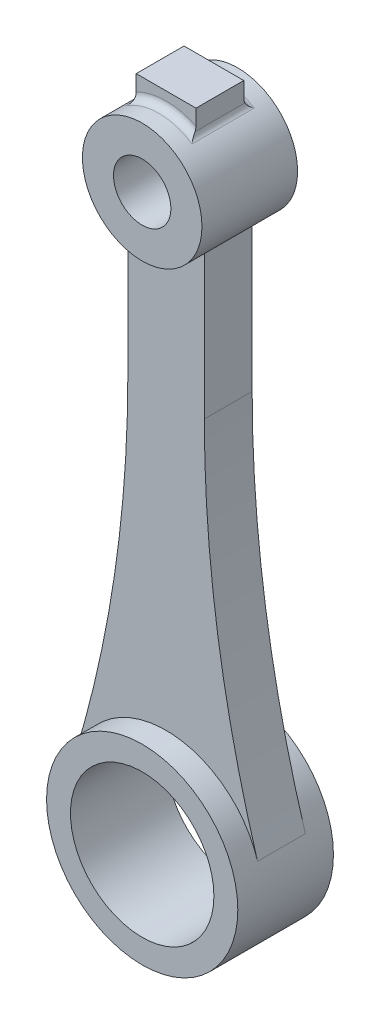
ISO-10303-21;
HEADER;
FILE_DESCRIPTION(('STEP AP214'),'2;1');
FILE_NAME('part.step','',(''),(''),'','','');
FILE_SCHEMA(('AUTOMOTIVE_DESIGN { 1 0 10303 214 1 1 1 1 }'));
ENDSEC;
DATA;
#1=APPLICATION_CONTEXT('core data for automotive mechanical design processes');
#2=APPLICATION_PROTOCOL_DEFINITION('international standard','automotive_design',2000,#1);
#3=PRODUCT_CONTEXT('',#1,'mechanical');
#4=PRODUCT('Part','Part','',(#3));
#5=PRODUCT_RELATED_PRODUCT_CATEGORY('part','',(#4));
#6=PRODUCT_DEFINITION_FORMATION('','',#4);
#7=PRODUCT_DEFINITION_CONTEXT('part definition',#1,'design');
#8=PRODUCT_DEFINITION('design','',#6,#7);
#9=PRODUCT_DEFINITION_SHAPE('','',#8);
#10=(LENGTH_UNIT() NAMED_UNIT(*) SI_UNIT(.MILLI.,.METRE.));
#11=(NAMED_UNIT(*) PLANE_ANGLE_UNIT() SI_UNIT($,.RADIAN.));
#12=(NAMED_UNIT(*) SI_UNIT($,.STERADIAN.) SOLID_ANGLE_UNIT());
#13=UNCERTAINTY_MEASURE_WITH_UNIT(LENGTH_MEASURE(1.E-05),#10,'distance_accuracy_value','');
#14=(GEOMETRIC_REPRESENTATION_CONTEXT(3) GLOBAL_UNCERTAINTY_ASSIGNED_CONTEXT((#13)) GLOBAL_UNIT_ASSIGNED_CONTEXT((#10,
#11,#12)) REPRESENTATION_CONTEXT('',''));
#15=CARTESIAN_POINT('',(0.,0.,0.));
#16=DIRECTION('',(0.,0.,1.));
#17=DIRECTION('',(1.,0.,0.));
#18=AXIS2_PLACEMENT_3D('',#15,#16,#17);
#19=CARTESIAN_POINT('',(0.,0.,10.));
#20=DIRECTION('',(0.,0.,1.));
#21=DIRECTION('',(1.,0.,0.));
#22=AXIS2_PLACEMENT_3D('',#19,#20,#21);
#23=PLANE('',#22);
#24=CARTESIAN_POINT('',(0.,0.,10.));
#25=DIRECTION('',(0.,0.,1.));
#26=DIRECTION('',(1.,0.,0.));
#27=AXIS2_PLACEMENT_3D('',#24,#25,#26);
#28=CIRCLE('',#27,20.);
#29=CARTESIAN_POINT('',(20.,0.,10.));
#30=VERTEX_POINT('',#29);
#31=EDGE_CURVE('E235',#30,#30,#28,.T.);
#32=ORIENTED_EDGE('',*,*,#31,.T.);
#33=EDGE_LOOP('',(#32));
#34=FACE_BOUND('',#33,.T.);
#35=CARTESIAN_POINT('',(0.,0.,10.));
#36=DIRECTION('',(0.,0.,1.));
#37=DIRECTION('',(1.,0.,0.));
#38=AXIS2_PLACEMENT_3D('',#35,#36,#37);
#39=CIRCLE('',#38,15.);
#40=CARTESIAN_POINT('',(15.,0.,10.));
#41=VERTEX_POINT('',#40);
#42=EDGE_CURVE('E229',#41,#41,#39,.T.);
#43=ORIENTED_EDGE('',*,*,#42,.F.);
#44=EDGE_LOOP('',(#43));
#45=FACE_BOUND('',#44,.T.);
#46=ADVANCED_FACE('F35',(#34,#45),#23,.T.);
#47=CARTESIAN_POINT('',(0.,0.,-10.));
#48=DIRECTION('',(0.,0.,1.));
#49=DIRECTION('',(1.,0.,0.));
#50=AXIS2_PLACEMENT_3D('',#47,#48,#49);
#51=PLANE('',#50);
#52=CARTESIAN_POINT('',(0.,0.,-10.));
#53=DIRECTION('',(0.,0.,1.));
#54=DIRECTION('',(1.,0.,0.));
#55=AXIS2_PLACEMENT_3D('',#52,#53,#54);
#56=CIRCLE('',#55,20.);
#57=CARTESIAN_POINT('',(20.,0.,-10.));
#58=VERTEX_POINT('',#57);
#59=EDGE_CURVE('E232',#58,#58,#56,.T.);
#60=ORIENTED_EDGE('',*,*,#59,.F.);
#61=EDGE_LOOP('',(#60));
#62=FACE_BOUND('',#61,.T.);
#63=CARTESIAN_POINT('',(0.,0.,-10.));
#64=DIRECTION('',(0.,0.,1.));
#65=DIRECTION('',(1.,0.,0.));
#66=AXIS2_PLACEMENT_3D('',#63,#64,#65);
#67=CIRCLE('',#66,15.);
#68=CARTESIAN_POINT('',(15.,0.,-10.));
#69=VERTEX_POINT('',#68);
#70=EDGE_CURVE('E228',#69,#69,#67,.T.);
#71=ORIENTED_EDGE('',*,*,#70,.T.);
#72=EDGE_LOOP('',(#71));
#73=FACE_BOUND('',#72,.T.);
#74=ADVANCED_FACE('F389',(#62,#73),#51,.F.);
#75=CARTESIAN_POINT('',(0.,0.,10.));
#76=DIRECTION('',(0.,0.,-1.));
#77=DIRECTION('',(-1.,0.,0.));
#78=AXIS2_PLACEMENT_3D('',#75,#76,#77);
#79=CYLINDRICAL_SURFACE('',#78,20.);
#80=DIRECTION('',(0.,0.,-1.));
#81=VECTOR('',#80,1.);
#82=CARTESIAN_POINT('',(19.1282509955381,5.84037788603577,5.));
#83=LINE('',#82,#81);
#84=CARTESIAN_POINT('',(19.1282509955381,5.84037788603577,5.));
#85=VERTEX_POINT('',#84);
#86=CARTESIAN_POINT('',(19.128250995538,5.84037788603575,-5.));
#87=VERTEX_POINT('',#86);
#88=EDGE_CURVE('E198',#85,#87,#83,.T.);
#89=ORIENTED_EDGE('',*,*,#88,.F.);
#90=CARTESIAN_POINT('',(0.,0.,5.));
#91=DIRECTION('',(0.,0.,-1.));
#92=DIRECTION('',(1.,0.,0.));
#93=AXIS2_PLACEMENT_3D('',#90,#91,#92);
#94=CIRCLE('',#93,20.);
#95=CARTESIAN_POINT('',(-19.1282509955381,5.84037788603577,5.));
#96=VERTEX_POINT('',#95);
#97=EDGE_CURVE('E195',#96,#85,#94,.T.);
#98=ORIENTED_EDGE('',*,*,#97,.F.);
#99=DIRECTION('',(0.,0.,-1.));
#100=VECTOR('',#99,1.);
#101=CARTESIAN_POINT('',(-19.128250995538,5.84037788603586,5.));
#102=LINE('',#101,#100);
#103=CARTESIAN_POINT('',(-19.128250995538,5.84037788603586,-5.));
#104=VERTEX_POINT('',#103);
#105=EDGE_CURVE('E214',#96,#104,#102,.T.);
#106=ORIENTED_EDGE('',*,*,#105,.T.);
#107=CARTESIAN_POINT('',(0.,0.,-5.));
#108=DIRECTION('',(0.,0.,-1.));
#109=DIRECTION('',(1.,0.,0.));
#110=AXIS2_PLACEMENT_3D('',#107,#108,#109);
#111=CIRCLE('',#110,20.);
#112=EDGE_CURVE('E186',#104,#87,#111,.T.);
#113=ORIENTED_EDGE('',*,*,#112,.T.);
#114=EDGE_LOOP('',(#89,#98,#106,#113));
#115=FACE_BOUND('',#114,.T.);
#116=ORIENTED_EDGE('',*,*,#31,.F.);
#117=EDGE_LOOP('',(#116));
#118=FACE_BOUND('',#117,.T.);
#119=ORIENTED_EDGE('',*,*,#59,.T.);
#120=EDGE_LOOP('',(#119));
#121=FACE_BOUND('',#120,.T.);
#122=ADVANCED_FACE('F385',(#115,#118,#121),#79,.T.);
#123=CARTESIAN_POINT('',(0.,0.,10.));
#124=DIRECTION('',(0.,0.,-1.));
#125=DIRECTION('',(-1.,0.,0.));
#126=AXIS2_PLACEMENT_3D('',#123,#124,#125);
#127=CYLINDRICAL_SURFACE('',#126,15.);
#128=ORIENTED_EDGE('',*,*,#42,.T.);
#129=EDGE_LOOP('',(#128));
#130=FACE_BOUND('',#129,.T.);
#131=ORIENTED_EDGE('',*,*,#70,.F.);
#132=EDGE_LOOP('',(#131));
#133=FACE_BOUND('',#132,.T.);
#134=ADVANCED_FACE('F381',(#130,#133),#127,.F.);
#135=CARTESIAN_POINT('',(263.308602328881,80.3953136438508,5.));
#136=DIRECTION('',(0.,0.,-1.));
#137=DIRECTION('',(-1.,0.,0.));
#138=AXIS2_PLACEMENT_3D('',#135,#136,#137);
#139=CYLINDRICAL_SURFACE('',#138,255.308602328881);
#140=CARTESIAN_POINT('',(263.308602328881,80.3953136438508,-5.));
#141=DIRECTION('',(0.,0.,-1.));
#142=DIRECTION('',(1.,0.,0.));
#143=AXIS2_PLACEMENT_3D('',#140,#141,#142);
#144=CIRCLE('',#143,255.308602328881);
#145=CARTESIAN_POINT('',(8.00000000000001,80.3953136438507,-5.));
#146=VERTEX_POINT('',#145);
#147=EDGE_CURVE('E179',#87,#146,#144,.T.);
#148=ORIENTED_EDGE('',*,*,#147,.T.);
#149=DIRECTION('',(0.,0.,-1.));
#150=VECTOR('',#149,1.);
#151=CARTESIAN_POINT('',(8.00000000000001,80.3953136438507,5.));
#152=LINE('',#151,#150);
#153=CARTESIAN_POINT('',(8.00000000000001,80.3953136438507,5.));
#154=VERTEX_POINT('',#153);
#155=EDGE_CURVE('E225',#154,#146,#152,.T.);
#156=ORIENTED_EDGE('',*,*,#155,.F.);
#157=CARTESIAN_POINT('',(263.308602328881,80.3953136438508,5.));
#158=DIRECTION('',(0.,0.,-1.));
#159=DIRECTION('',(1.,0.,0.));
#160=AXIS2_PLACEMENT_3D('',#157,#158,#159);
#161=CIRCLE('',#160,255.308602328881);
#162=EDGE_CURVE('E182',#85,#154,#161,.T.);
#163=ORIENTED_EDGE('',*,*,#162,.F.);
#164=ORIENTED_EDGE('',*,*,#88,.T.);
#165=EDGE_LOOP('',(#148,#156,#163,#164));
#166=FACE_BOUND('',#165,.T.);
#167=ADVANCED_FACE('F377',(#166),#139,.F.);
#168=CARTESIAN_POINT('',(8.,110.395313643851,5.));
#169=DIRECTION('',(-1.,0.,0.));
#170=DIRECTION('',(0.,-1.,0.));
#171=AXIS2_PLACEMENT_3D('',#168,#169,#170);
#172=PLANE('',#171);
#173=DIRECTION('',(0.,1.,0.));
#174=VECTOR('',#173,1.);
#175=CARTESIAN_POINT('',(8.,110.395313643851,-5.));
#176=LINE('',#175,#174);
#177=CARTESIAN_POINT('',(8.,110.395313643851,-5.));
#178=VERTEX_POINT('',#177);
#179=EDGE_CURVE('E201',#146,#178,#176,.T.);
#180=ORIENTED_EDGE('',*,*,#179,.T.);
#181=DIRECTION('',(0.,0.,-1.));
#182=VECTOR('',#181,1.);
#183=CARTESIAN_POINT('',(8.,110.395313643851,5.));
#184=LINE('',#183,#182);
#185=CARTESIAN_POINT('',(8.,110.395313643851,5.));
#186=VERTEX_POINT('',#185);
#187=EDGE_CURVE('E222',#186,#178,#184,.T.);
#188=ORIENTED_EDGE('',*,*,#187,.F.);
#189=DIRECTION('',(0.,1.,0.));
#190=VECTOR('',#189,1.);
#191=CARTESIAN_POINT('',(8.,110.395313643851,5.));
#192=LINE('',#191,#190);
#193=EDGE_CURVE('E185',#154,#186,#192,.T.);
#194=ORIENTED_EDGE('',*,*,#193,.F.);
#195=ORIENTED_EDGE('',*,*,#155,.T.);
#196=EDGE_LOOP('',(#180,#188,#194,#195));
#197=FACE_BOUND('',#196,.T.);
#198=ADVANCED_FACE('F373',(#197),#172,.F.);
#199=CARTESIAN_POINT('',(-8.,110.395313643851,5.));
#200=DIRECTION('',(1.,0.,0.));
#201=DIRECTION('',(0.,1.,0.));
#202=AXIS2_PLACEMENT_3D('',#199,#200,#201);
#203=PLANE('',#202);
#204=DIRECTION('',(0.,-1.,0.));
#205=VECTOR('',#204,1.);
#206=CARTESIAN_POINT('',(-8.,110.395313643851,-5.));
#207=LINE('',#206,#205);
#208=CARTESIAN_POINT('',(-8.,110.395313643851,-5.));
#209=VERTEX_POINT('',#208);
#210=CARTESIAN_POINT('',(-8.00000000000001,80.3953136438507,-5.));
#211=VERTEX_POINT('',#210);
#212=EDGE_CURVE('E206',#209,#211,#207,.T.);
#213=ORIENTED_EDGE('',*,*,#212,.T.);
#214=DIRECTION('',(0.,0.,-1.));
#215=VECTOR('',#214,1.);
#216=CARTESIAN_POINT('',(-8.00000000000001,80.3953136438507,5.));
#217=LINE('',#216,#215);
#218=CARTESIAN_POINT('',(-8.00000000000001,80.3953136438507,5.));
#219=VERTEX_POINT('',#218);
#220=EDGE_CURVE('E216',#219,#211,#217,.T.);
#221=ORIENTED_EDGE('',*,*,#220,.F.);
#222=DIRECTION('',(0.,-1.,0.));
#223=VECTOR('',#222,1.);
#224=CARTESIAN_POINT('',(-8.,110.395313643851,5.));
#225=LINE('',#224,#223);
#226=CARTESIAN_POINT('',(-8.,110.395313643851,5.));
#227=VERTEX_POINT('',#226);
#228=EDGE_CURVE('E190',#227,#219,#225,.T.);
#229=ORIENTED_EDGE('',*,*,#228,.F.);
#230=DIRECTION('',(0.,0.,-1.));
#231=VECTOR('',#230,1.);
#232=CARTESIAN_POINT('',(-8.,110.395313643851,5.));
#233=LINE('',#232,#231);
#234=EDGE_CURVE('E219',#227,#209,#233,.T.);
#235=ORIENTED_EDGE('',*,*,#234,.T.);
#236=EDGE_LOOP('',(#213,#221,#229,#235));
#237=FACE_BOUND('',#236,.T.);
#238=ADVANCED_FACE('F369',(#237),#203,.F.);
#239=CARTESIAN_POINT('',(-263.308602328881,80.3953136438508,5.));
#240=DIRECTION('',(0.,0.,-1.));
#241=DIRECTION('',(-1.,0.,0.));
#242=AXIS2_PLACEMENT_3D('',#239,#240,#241);
#243=CYLINDRICAL_SURFACE('',#242,255.308602328881);
#244=CARTESIAN_POINT('',(-263.308602328881,80.3953136438508,-5.));
#245=DIRECTION('',(0.,0.,-1.));
#246=DIRECTION('',(-1.,0.,0.));
#247=AXIS2_PLACEMENT_3D('',#244,#245,#246);
#248=CIRCLE('',#247,255.308602328881);
#249=EDGE_CURVE('E208',#211,#104,#248,.T.);
#250=ORIENTED_EDGE('',*,*,#249,.T.);
#251=ORIENTED_EDGE('',*,*,#105,.F.);
#252=CARTESIAN_POINT('',(-263.308602328881,80.3953136438508,5.));
#253=DIRECTION('',(0.,0.,-1.));
#254=DIRECTION('',(-1.,0.,0.));
#255=AXIS2_PLACEMENT_3D('',#252,#253,#254);
#256=CIRCLE('',#255,255.308602328881);
#257=EDGE_CURVE('E192',#219,#96,#256,.T.);
#258=ORIENTED_EDGE('',*,*,#257,.F.);
#259=ORIENTED_EDGE('',*,*,#220,.T.);
#260=EDGE_LOOP('',(#250,#251,#258,#259));
#261=FACE_BOUND('',#260,.T.);
#262=ADVANCED_FACE('F362',(#261),#243,.F.);
#263=CARTESIAN_POINT('',(263.308602328881,80.3953136438508,5.));
#264=DIRECTION('',(0.,0.,1.));
#265=DIRECTION('',(1.,0.,0.));
#266=AXIS2_PLACEMENT_3D('',#263,#264,#265);
#267=PLANE('',#266);
#268=ORIENTED_EDGE('',*,*,#162,.T.);
#269=ORIENTED_EDGE('',*,*,#193,.T.);
#270=CARTESIAN_POINT('',(0.,120.,5.));
#271=DIRECTION('',(0.,0.,-1.));
#272=DIRECTION('',(1.,0.,0.));
#273=AXIS2_PLACEMENT_3D('',#270,#271,#272);
#274=CIRCLE('',#273,12.5);
#275=EDGE_CURVE('E188',#186,#227,#274,.T.);
#276=ORIENTED_EDGE('',*,*,#275,.T.);
#277=ORIENTED_EDGE('',*,*,#228,.T.);
#278=ORIENTED_EDGE('',*,*,#257,.T.);
#279=ORIENTED_EDGE('',*,*,#97,.T.);
#280=EDGE_LOOP('',(#268,#269,#276,#277,#278,#279));
#281=FACE_BOUND('',#280,.T.);
#282=ADVANCED_FACE('F359',(#281),#267,.T.);
#283=CARTESIAN_POINT('',(263.308602328881,80.3953136438508,-5.));
#284=DIRECTION('',(0.,0.,1.));
#285=DIRECTION('',(1.,0.,0.));
#286=AXIS2_PLACEMENT_3D('',#283,#284,#285);
#287=PLANE('',#286);
#288=ORIENTED_EDGE('',*,*,#147,.F.);
#289=ORIENTED_EDGE('',*,*,#112,.F.);
#290=ORIENTED_EDGE('',*,*,#249,.F.);
#291=ORIENTED_EDGE('',*,*,#212,.F.);
#292=CARTESIAN_POINT('',(0.,120.,-5.));
#293=DIRECTION('',(0.,0.,-1.));
#294=DIRECTION('',(1.,0.,0.));
#295=AXIS2_PLACEMENT_3D('',#292,#293,#294);
#296=CIRCLE('',#295,12.5);
#297=EDGE_CURVE('E203',#178,#209,#296,.T.);
#298=ORIENTED_EDGE('',*,*,#297,.F.);
#299=ORIENTED_EDGE('',*,*,#179,.F.);
#300=EDGE_LOOP('',(#288,#289,#290,#291,#298,#299));
#301=FACE_BOUND('',#300,.T.);
#302=ADVANCED_FACE('F352',(#301),#287,.F.);
#303=CARTESIAN_POINT('',(0.,120.,10.));
#304=DIRECTION('',(0.,0.,1.));
#305=DIRECTION('',(1.,0.,0.));
#306=AXIS2_PLACEMENT_3D('',#303,#304,#305);
#307=PLANE('',#306);
#308=CARTESIAN_POINT('',(0.,120.,10.));
#309=DIRECTION('',(0.,0.,1.));
#310=DIRECTION('',(1.,0.,0.));
#311=AXIS2_PLACEMENT_3D('',#308,#309,#310);
#312=CIRCLE('',#311,12.5);
#313=CARTESIAN_POINT('',(12.5,120.,10.));
#314=VERTEX_POINT('',#313);
#315=EDGE_CURVE('E176',#314,#314,#312,.T.);
#316=ORIENTED_EDGE('',*,*,#315,.T.);
#317=EDGE_LOOP('',(#316));
#318=FACE_BOUND('',#317,.T.);
#319=CARTESIAN_POINT('',(0.,120.,10.));
#320=DIRECTION('',(0.,0.,1.));
#321=DIRECTION('',(1.,0.,0.));
#322=AXIS2_PLACEMENT_3D('',#319,#320,#321);
#323=CIRCLE('',#322,6.);
#324=CARTESIAN_POINT('',(6.,120.,10.));
#325=VERTEX_POINT('',#324);
#326=EDGE_CURVE('E168',#325,#325,#323,.T.);
#327=ORIENTED_EDGE('',*,*,#326,.F.);
#328=EDGE_LOOP('',(#327));
#329=FACE_BOUND('',#328,.T.);
#330=ADVANCED_FACE('F348',(#318,#329),#307,.T.);
#331=CARTESIAN_POINT('',(0.,120.,-10.));
#332=DIRECTION('',(0.,0.,1.));
#333=DIRECTION('',(1.,0.,0.));
#334=AXIS2_PLACEMENT_3D('',#331,#332,#333);
#335=PLANE('',#334);
#336=CARTESIAN_POINT('',(0.,120.,-10.));
#337=DIRECTION('',(0.,0.,1.));
#338=DIRECTION('',(1.,0.,0.));
#339=AXIS2_PLACEMENT_3D('',#336,#337,#338);
#340=CIRCLE('',#339,12.5);
#341=CARTESIAN_POINT('',(12.5,120.,-10.));
#342=VERTEX_POINT('',#341);
#343=EDGE_CURVE('E174',#342,#342,#340,.T.);
#344=ORIENTED_EDGE('',*,*,#343,.F.);
#345=EDGE_LOOP('',(#344));
#346=FACE_BOUND('',#345,.T.);
#347=CARTESIAN_POINT('',(0.,120.,-10.));
#348=DIRECTION('',(0.,0.,1.));
#349=DIRECTION('',(1.,0.,0.));
#350=AXIS2_PLACEMENT_3D('',#347,#348,#349);
#351=CIRCLE('',#350,6.);
#352=CARTESIAN_POINT('',(6.,120.,-10.));
#353=VERTEX_POINT('',#352);
#354=EDGE_CURVE('E164',#353,#353,#351,.T.);
#355=ORIENTED_EDGE('',*,*,#354,.T.);
#356=EDGE_LOOP('',(#355));
#357=FACE_BOUND('',#356,.T.);
#358=ADVANCED_FACE('F351',(#346,#357),#335,.F.);
#359=CARTESIAN_POINT('',(0.,120.,10.));
#360=DIRECTION('',(0.,0.,-1.));
#361=DIRECTION('',(-1.,0.,0.));
#362=AXIS2_PLACEMENT_3D('',#359,#360,#361);
#363=CYLINDRICAL_SURFACE('',#362,12.5);
#364=CARTESIAN_POINT('',(0.,120.,6.5));
#365=DIRECTION('',(0.,0.,1.));
#366=DIRECTION('',(1.,0.,0.));
#367=AXIS2_PLACEMENT_3D('',#364,#365,#366);
#368=CIRCLE('',#367,12.5);
#369=CARTESIAN_POINT('',(6.91964285714287,130.410021264608,6.5));
#370=VERTEX_POINT('',#369);
#371=CARTESIAN_POINT('',(-6.91964285714287,130.410021264608,6.5));
#372=VERTEX_POINT('',#371);
#373=EDGE_CURVE('E242',#370,#372,#368,.T.);
#374=ORIENTED_EDGE('',*,*,#373,.T.);
#375=DIRECTION('',(0.,0.,-1.));
#376=VECTOR('',#375,1.);
#377=CARTESIAN_POINT('',(-6.91964285714287,130.410021264608,10.));
#378=LINE('',#377,#376);
#379=CARTESIAN_POINT('',(-6.91964285714287,130.410021264608,-6.5));
#380=VERTEX_POINT('',#379);
#381=EDGE_CURVE('E246',#372,#380,#378,.T.);
#382=ORIENTED_EDGE('',*,*,#381,.T.);
#383=CARTESIAN_POINT('',(0.,120.,-6.5));
#384=DIRECTION('',(0.,0.,1.));
#385=DIRECTION('',(1.,0.,0.));
#386=AXIS2_PLACEMENT_3D('',#383,#384,#385);
#387=CIRCLE('',#386,12.5);
#388=CARTESIAN_POINT('',(6.91964285714287,130.410021264608,-6.5));
#389=VERTEX_POINT('',#388);
#390=EDGE_CURVE('E244',#380,#389,#387,.F.);
#391=ORIENTED_EDGE('',*,*,#390,.T.);
#392=DIRECTION('',(0.,0.,-1.));
#393=VECTOR('',#392,1.);
#394=CARTESIAN_POINT('',(6.91964285714287,130.410021264608,10.));
#395=LINE('',#394,#393);
#396=EDGE_CURVE('E238',#389,#370,#395,.F.);
#397=ORIENTED_EDGE('',*,*,#396,.T.);
#398=EDGE_LOOP('',(#374,#382,#391,#397));
#399=FACE_BOUND('',#398,.T.);
#400=ORIENTED_EDGE('',*,*,#275,.F.);
#401=ORIENTED_EDGE('',*,*,#187,.T.);
#402=ORIENTED_EDGE('',*,*,#297,.T.);
#403=ORIENTED_EDGE('',*,*,#234,.F.);
#404=EDGE_LOOP('',(#400,#401,#402,#403));
#405=FACE_BOUND('',#404,.T.);
#406=ORIENTED_EDGE('',*,*,#315,.F.);
#407=EDGE_LOOP('',(#406));
#408=FACE_BOUND('',#407,.T.);
#409=ORIENTED_EDGE('',*,*,#343,.T.);
#410=EDGE_LOOP('',(#409));
#411=FACE_BOUND('',#410,.T.);
#412=ADVANCED_FACE('F316',(#399,#405,#408,#411),#363,.T.);
#413=CARTESIAN_POINT('',(0.,120.,10.));
#414=DIRECTION('',(0.,0.,-1.));
#415=DIRECTION('',(-1.,0.,0.));
#416=AXIS2_PLACEMENT_3D('',#413,#414,#415);
#417=CYLINDRICAL_SURFACE('',#416,6.);
#418=ORIENTED_EDGE('',*,*,#326,.T.);
#419=EDGE_LOOP('',(#418));
#420=FACE_BOUND('',#419,.T.);
#421=ORIENTED_EDGE('',*,*,#354,.F.);
#422=EDGE_LOOP('',(#421));
#423=FACE_BOUND('',#422,.T.);
#424=ADVANCED_FACE('F344',(#420,#423),#417,.F.);
#425=CARTESIAN_POINT('',(-6.25000000000002,135.825317547305,5.));
#426=DIRECTION('',(0.,-1.,0.));
#427=DIRECTION('',(0.,0.,-1.));
#428=AXIS2_PLACEMENT_3D('',#425,#426,#427);
#429=PLANE('',#428);
#430=DIRECTION('',(-1.,0.,0.));
#431=VECTOR('',#430,1.);
#432=CARTESIAN_POINT('',(-6.25000000000002,135.825317547305,-5.));
#433=LINE('',#432,#431);
#434=CARTESIAN_POINT('',(6.24999999999998,135.825317547305,-5.));
#435=VERTEX_POINT('',#434);
#436=CARTESIAN_POINT('',(-6.25000000000002,135.825317547305,-5.));
#437=VERTEX_POINT('',#436);
#438=EDGE_CURVE('E163',#435,#437,#433,.T.);
#439=ORIENTED_EDGE('',*,*,#438,.T.);
#440=DIRECTION('',(0.,0.,-1.));
#441=VECTOR('',#440,1.);
#442=CARTESIAN_POINT('',(-6.25000000000002,135.825317547305,5.));
#443=LINE('',#442,#441);
#444=CARTESIAN_POINT('',(-6.25000000000002,135.825317547305,5.));
#445=VERTEX_POINT('',#444);
#446=EDGE_CURVE('E145',#445,#437,#443,.T.);
#447=ORIENTED_EDGE('',*,*,#446,.F.);
#448=DIRECTION('',(-1.,0.,0.));
#449=VECTOR('',#448,1.);
#450=CARTESIAN_POINT('',(-6.25000000000002,135.825317547305,5.));
#451=LINE('',#450,#449);
#452=CARTESIAN_POINT('',(6.24999999999998,135.825317547305,5.));
#453=VERTEX_POINT('',#452);
#454=EDGE_CURVE('E151',#453,#445,#451,.T.);
#455=ORIENTED_EDGE('',*,*,#454,.F.);
#456=DIRECTION('',(0.,0.,-1.));
#457=VECTOR('',#456,1.);
#458=CARTESIAN_POINT('',(6.24999999999998,135.825317547305,5.));
#459=LINE('',#458,#457);
#460=EDGE_CURVE('E165',#453,#435,#459,.T.);
#461=ORIENTED_EDGE('',*,*,#460,.T.);
#462=EDGE_LOOP('',(#439,#447,#455,#461));
#463=FACE_BOUND('',#462,.T.);
#464=ADVANCED_FACE('F161',(#463),#429,.F.);
#465=CARTESIAN_POINT('',(-6.25000000000002,135.825317547305,5.));
#466=DIRECTION('',(1.,0.,0.));
#467=DIRECTION('',(0.,1.,0.));
#468=AXIS2_PLACEMENT_3D('',#465,#466,#467);
#469=PLANE('',#468);
#470=DIRECTION('',(0.,-1.,0.));
#471=VECTOR('',#470,1.);
#472=CARTESIAN_POINT('',(-6.25000000000002,135.825317547305,-5.));
#473=LINE('',#472,#471);
#474=CARTESIAN_POINT('',(-6.25000000000002,132.527469816367,-5.));
#475=VERTEX_POINT('',#474);
#476=EDGE_CURVE('E325',#437,#475,#473,.T.);
#477=ORIENTED_EDGE('',*,*,#476,.T.);
#478=CARTESIAN_POINT('',(-6.25000000000129,132.527469816367,-5.));
#479=CARTESIAN_POINT('',(-6.25000000000046,132.421474584728,-4.99995476685734));
#480=CARTESIAN_POINT('',(-6.25000000000013,132.315375625552,-5.00899530953789));
#481=CARTESIAN_POINT('',(-6.24999999999991,132.108309727727,-5.04438410573177));
#482=CARTESIAN_POINT('',(-6.25,132.007282481463,-5.07038043253437));
#483=CARTESIAN_POINT('',(-6.25000000000003,131.866465757431,-5.11955531131258));
#484=CARTESIAN_POINT('',(-6.25000000000002,131.824266958783,-5.13605757336144));
#485=CARTESIAN_POINT('',(-6.25000000000001,131.740846367429,-5.17232225321434));
#486=CARTESIAN_POINT('',(-6.25000000000001,131.699636664042,-5.19211246740856));
#487=CARTESIAN_POINT('',(-6.25000000000002,131.659223816361,-5.21346063058965));
#488=B_SPLINE_CURVE_WITH_KNOTS('',3,(#478,#479,#480,#481,#482,#483,#484,#485,#486,#487),
.UNSPECIFIED.,.F.,.F.,(4,2,2,2,4),(0.,0.317817238810132,0.629239350438666,0.765064192464121,
0.902101912336235),.UNSPECIFIED.);
#489=CARTESIAN_POINT('',(-6.25000000000002,131.659223816361,-5.21346063058952));
#490=VERTEX_POINT('',#489);
#491=EDGE_CURVE('E264',#475,#490,#488,.T.);
#492=ORIENTED_EDGE('',*,*,#491,.T.);
#493=DIRECTION('',(0.,0.,1.));
#494=VECTOR('',#493,1.);
#495=CARTESIAN_POINT('',(-6.25000000000002,131.659223816361,5.));
#496=LINE('',#495,#494);
#497=CARTESIAN_POINT('',(-6.25000000000002,131.659223816361,5.21346063058952));
#498=VERTEX_POINT('',#497);
#499=EDGE_CURVE('E249',#490,#498,#496,.T.);
#500=ORIENTED_EDGE('',*,*,#499,.T.);
#501=CARTESIAN_POINT('',(-6.25000000000002,131.659223816361,5.21346063058952));
#502=CARTESIAN_POINT('',(-6.25000000000002,131.752311191975,5.16424446032767));
#503=CARTESIAN_POINT('',(-6.25000000000002,131.849761219296,5.12332058684711));
#504=CARTESIAN_POINT('',(-6.25000000000002,132.048204621925,5.05916061918915));
#505=CARTESIAN_POINT('',(-6.25000000000002,132.149090060202,5.03559127533277));
#506=CARTESIAN_POINT('',(-6.25000000000002,132.296653143681,5.01366539711515));
#507=CARTESIAN_POINT('',(-6.25000000000002,132.342414489118,5.00857452701163));
#508=CARTESIAN_POINT('',(-6.25000000000002,132.434598455898,5.00172830380905));
#509=CARTESIAN_POINT('',(-6.25000000000002,132.481023328131,5.00000325315169));
#510=CARTESIAN_POINT('',(-6.25000000000002,132.527469816367,4.99999999999997));
#511=B_SPLINE_CURVE_WITH_KNOTS('',3,(#501,#502,#503,#504,#505,#506,#507,#508,#509,#510),
.UNSPECIFIED.,.F.,.F.,(4,2,2,2,4),(0.,0.315516394441633,0.624803717398757,0.762831525218306,
0.90209636453908),.UNSPECIFIED.);
#512=CARTESIAN_POINT('',(-6.25000000000002,132.527469816367,5.));
#513=VERTEX_POINT('',#512);
#514=EDGE_CURVE('E11',#498,#513,#511,.T.);
#515=ORIENTED_EDGE('',*,*,#514,.T.);
#516=DIRECTION('',(0.,-1.,0.));
#517=VECTOR('',#516,1.);
#518=CARTESIAN_POINT('',(-6.25000000000002,135.825317547305,5.));
#519=LINE('',#518,#517);
#520=EDGE_CURVE('E140',#445,#513,#519,.T.);
#521=ORIENTED_EDGE('',*,*,#520,.F.);
#522=ORIENTED_EDGE('',*,*,#446,.T.);
#523=EDGE_LOOP('',(#477,#492,#500,#515,#521,#522));
#524=FACE_BOUND('',#523,.T.);
#525=ADVANCED_FACE('F143',(#524),#469,.F.);
#526=CARTESIAN_POINT('',(6.24999999999998,135.825317547305,5.));
#527=DIRECTION('',(-1.,0.,0.));
#528=DIRECTION('',(0.,-1.,0.));
#529=AXIS2_PLACEMENT_3D('',#526,#527,#528);
#530=PLANE('',#529);
#531=CARTESIAN_POINT('',(6.25000000000001,132.527469816368,5.));
#532=CARTESIAN_POINT('',(6.25000000000001,132.421474584729,4.99995476685731));
#533=CARTESIAN_POINT('',(6.25000000000001,132.315375625552,5.00899530953784));
#534=CARTESIAN_POINT('',(6.25000000000001,132.108309727727,5.0443841057317));
#535=CARTESIAN_POINT('',(6.25000000000001,132.007282481463,5.07038043253431));
#536=CARTESIAN_POINT('',(6.25000000000001,131.866465757431,5.11955531131255));
#537=CARTESIAN_POINT('',(6.25000000000001,131.824266958783,5.13605757336141));
#538=CARTESIAN_POINT('',(6.25000000000001,131.740846367429,5.17232225321432));
#539=CARTESIAN_POINT('',(6.25000000000002,131.699636664042,5.19211246740855));
#540=CARTESIAN_POINT('',(6.25000000000002,131.659223816361,5.21346063058965));
#541=B_SPLINE_CURVE_WITH_KNOTS('',3,(#531,#532,#533,#534,#535,#536,#537,#538,#539,#540),
.UNSPECIFIED.,.F.,.F.,(4,2,2,2,4),(0.,0.317817238810432,0.629239350439185,0.765064192464698,
0.902101912336871),.UNSPECIFIED.);
#542=CARTESIAN_POINT('',(6.25000000000001,132.527469816368,5.));
#543=VERTEX_POINT('',#542);
#544=CARTESIAN_POINT('',(6.25000000000002,131.659223816361,5.21346063058952));
#545=VERTEX_POINT('',#544);
#546=EDGE_CURVE('E49',#543,#545,#541,.T.);
#547=ORIENTED_EDGE('',*,*,#546,.T.);
#548=DIRECTION('',(0.,0.,1.));
#549=VECTOR('',#548,1.);
#550=CARTESIAN_POINT('',(6.25000000000002,131.659223816361,-5.));
#551=LINE('',#550,#549);
#552=CARTESIAN_POINT('',(6.25000000000002,131.659223816361,-5.21346063058952));
#553=VERTEX_POINT('',#552);
#554=EDGE_CURVE('E57',#545,#553,#551,.F.);
#555=ORIENTED_EDGE('',*,*,#554,.T.);
#556=CARTESIAN_POINT('',(6.25000000000002,131.659223816361,-5.21346063058952));
#557=CARTESIAN_POINT('',(6.25000000000001,131.752311191975,-5.16424446032767));
#558=CARTESIAN_POINT('',(6.25000000000001,131.849761219296,-5.12332058684711));
#559=CARTESIAN_POINT('',(6.25000000000001,132.048204621925,-5.05916061918915));
#560=CARTESIAN_POINT('',(6.25000000000001,132.149090060202,-5.03559127533277));
#561=CARTESIAN_POINT('',(6.25000000000001,132.296653143681,-5.01366539711513));
#562=CARTESIAN_POINT('',(6.25000000000001,132.342414489118,-5.00857452701161));
#563=CARTESIAN_POINT('',(6.25000000000001,132.434598455899,-5.00172830380903));
#564=CARTESIAN_POINT('',(6.25000000000001,132.481023328132,-5.00000325315167));
#565=CARTESIAN_POINT('',(6.25000000000001,132.527469816368,-4.99999999999997));
#566=B_SPLINE_CURVE_WITH_KNOTS('',3,(#556,#557,#558,#559,#560,#561,#562,#563,#564,#565),
.UNSPECIFIED.,.F.,.F.,(4,2,2,2,4),(0.,0.315516394441633,0.624803717398757,0.762831525218613,
0.90209636453969),.UNSPECIFIED.);
#567=CARTESIAN_POINT('',(6.25000000000001,132.527469816368,-5.));
#568=VERTEX_POINT('',#567);
#569=EDGE_CURVE('E256',#553,#568,#566,.T.);
#570=ORIENTED_EDGE('',*,*,#569,.T.);
#571=DIRECTION('',(0.,1.,0.));
#572=VECTOR('',#571,1.);
#573=CARTESIAN_POINT('',(6.24999999999998,135.825317547305,-5.));
#574=LINE('',#573,#572);
#575=EDGE_CURVE('E159',#568,#435,#574,.T.);
#576=ORIENTED_EDGE('',*,*,#575,.T.);
#577=ORIENTED_EDGE('',*,*,#460,.F.);
#578=DIRECTION('',(0.,1.,0.));
#579=VECTOR('',#578,1.);
#580=CARTESIAN_POINT('',(6.24999999999998,135.825317547305,5.));
#581=LINE('',#580,#579);
#582=EDGE_CURVE('E150',#543,#453,#581,.T.);
#583=ORIENTED_EDGE('',*,*,#582,.F.);
#584=EDGE_LOOP('',(#547,#555,#570,#576,#577,#583));
#585=FACE_BOUND('',#584,.T.);
#586=ADVANCED_FACE('F271',(#585),#530,.F.);
#587=CARTESIAN_POINT('',(0.,120.,5.));
#588=DIRECTION('',(0.,0.,1.));
#589=DIRECTION('',(1.,0.,0.));
#590=AXIS2_PLACEMENT_3D('',#587,#588,#589);
#591=PLANE('',#590);
#592=ORIENTED_EDGE('',*,*,#520,.T.);
#593=CARTESIAN_POINT('',(0.,120.,5.));
#594=DIRECTION('',(0.,0.,1.));
#595=DIRECTION('',(1.,0.,0.));
#596=AXIS2_PLACEMENT_3D('',#593,#594,#595);
#597=CIRCLE('',#596,14.);
#598=EDGE_CURVE('E253',#513,#543,#597,.F.);
#599=ORIENTED_EDGE('',*,*,#598,.T.);
#600=ORIENTED_EDGE('',*,*,#582,.T.);
#601=ORIENTED_EDGE('',*,*,#454,.T.);
#602=EDGE_LOOP('',(#592,#599,#600,#601));
#603=FACE_BOUND('',#602,.T.);
#604=ADVANCED_FACE('F154',(#603),#591,.T.);
#605=CARTESIAN_POINT('',(0.,120.,-5.));
#606=DIRECTION('',(0.,0.,1.));
#607=DIRECTION('',(1.,0.,0.));
#608=AXIS2_PLACEMENT_3D('',#605,#606,#607);
#609=PLANE('',#608);
#610=ORIENTED_EDGE('',*,*,#575,.F.);
#611=CARTESIAN_POINT('',(0.,120.,-5.));
#612=DIRECTION('',(0.,0.,1.));
#613=DIRECTION('',(1.,0.,0.));
#614=AXIS2_PLACEMENT_3D('',#611,#612,#613);
#615=CIRCLE('',#614,14.);
#616=EDGE_CURVE('E251',#568,#475,#615,.T.);
#617=ORIENTED_EDGE('',*,*,#616,.T.);
#618=ORIENTED_EDGE('',*,*,#476,.F.);
#619=ORIENTED_EDGE('',*,*,#438,.F.);
#620=EDGE_LOOP('',(#610,#617,#618,#619));
#621=FACE_BOUND('',#620,.T.);
#622=ADVANCED_FACE('F329',(#621),#609,.F.);
#623=CARTESIAN_POINT('',(7.75000000000002,131.659223816361,10.));
#624=DIRECTION('',(0.,0.,-1.));
#625=DIRECTION('',(-1.,0.,0.));
#626=AXIS2_PLACEMENT_3D('',#623,#624,#625);
#627=CYLINDRICAL_SURFACE('',#626,1.5);
#628=ORIENTED_EDGE('',*,*,#554,.F.);
#629=CARTESIAN_POINT('',(6.25000000000002,131.659223816361,5.21346063058952));
#630=CARTESIAN_POINT('',(6.2500063854588,131.612332008452,5.2382390970095));
#631=CARTESIAN_POINT('',(6.25219748490573,131.566347766414,5.26458128424851));
#632=CARTESIAN_POINT('',(6.2604926178623,131.476455941514,5.31984819830485));
#633=CARTESIAN_POINT('',(6.26658799954839,131.432543996913,5.34876709349817));
#634=CARTESIAN_POINT('',(6.28993313157369,131.304723531496,5.43824617056945));
#635=CARTESIAN_POINT('',(6.31225758029675,131.22393813967,5.50196130038864));
#636=CARTESIAN_POINT('',(6.37743349045801,131.044271220488,5.65836916740769));
#637=CARTESIAN_POINT('',(6.4247488085142,130.949065472676,5.75335270154145));
#638=CARTESIAN_POINT('',(6.53448577221973,130.774229749857,5.94909271503378));
#639=CARTESIAN_POINT('',(6.59696099403628,130.694656868529,6.04986867933677));
#640=CARTESIAN_POINT('',(6.7416589573725,130.543274670194,6.26507617263487));
#641=CARTESIAN_POINT('',(6.82528156078008,130.473215502851,6.37981236829729));
#642=CARTESIAN_POINT('',(6.9166910022573,130.411987182845,6.49624664618255));
#643=CARTESIAN_POINT('',(6.91816608526864,130.411002905504,6.49812335109172));
#644=CARTESIAN_POINT('',(6.91964285714288,130.410021264608,6.5));
#645=B_SPLINE_CURVE_WITH_KNOTS('',3,(#629,#630,#631,#632,#633,#634,#635,#636,#637,#638,#639,
#640,#641,#642,#643,#644),.UNSPECIFIED.,.F.,.F.,(4,2,2,2,2,2,2,4),(0.,0.158921145922187,
0.317491337925636,0.631963862353099,1.0574219936334,1.48440620162472,1.95722254786928,
1.96496852030664),.UNSPECIFIED.);
#646=EDGE_CURVE('E40',#370,#545,#645,.F.);
#647=ORIENTED_EDGE('',*,*,#646,.F.);
#648=ORIENTED_EDGE('',*,*,#396,.F.);
#649=CARTESIAN_POINT('',(6.25000000000002,131.659223816361,-5.21346063058952));
#650=CARTESIAN_POINT('',(6.2500063854588,131.612332008452,-5.2382390970095));
#651=CARTESIAN_POINT('',(6.25219748490573,131.566347766414,-5.26458128424851));
#652=CARTESIAN_POINT('',(6.2604926178623,131.476455941514,-5.31984819830485));
#653=CARTESIAN_POINT('',(6.26658799954839,131.432543996913,-5.34876709349817));
#654=CARTESIAN_POINT('',(6.28993313157369,131.304723531496,-5.43824617056945));
#655=CARTESIAN_POINT('',(6.31225758029675,131.22393813967,-5.50196130038864));
#656=CARTESIAN_POINT('',(6.37743349045801,131.044271220488,-5.65836916740769));
#657=CARTESIAN_POINT('',(6.4247488085142,130.949065472676,-5.75335270154145));
#658=CARTESIAN_POINT('',(6.53448577221973,130.774229749857,-5.94909271503378));
#659=CARTESIAN_POINT('',(6.59696099403628,130.694656868529,-6.04986867933677));
#660=CARTESIAN_POINT('',(6.7416589573725,130.543274670194,-6.26507617263487));
#661=CARTESIAN_POINT('',(6.82528156078008,130.473215502851,-6.37981236829729));
#662=CARTESIAN_POINT('',(6.9166910022573,130.411987182845,-6.49624664618255));
#663=CARTESIAN_POINT('',(6.91816608526864,130.411002905504,-6.49812335109172));
#664=CARTESIAN_POINT('',(6.91964285714288,130.410021264608,-6.5));
#665=B_SPLINE_CURVE_WITH_KNOTS('',3,(#649,#650,#651,#652,#653,#654,#655,#656,#657,#658,#659,
#660,#661,#662,#663,#664),.UNSPECIFIED.,.F.,.F.,(4,2,2,2,2,2,2,4),(0.,0.158921145922187,
0.317491337925636,0.631963862353099,1.0574219936334,1.48440620162472,1.95722254786928,
1.96496852030664),.UNSPECIFIED.);
#666=EDGE_CURVE('E294',#553,#389,#665,.T.);
#667=ORIENTED_EDGE('',*,*,#666,.F.);
#668=EDGE_LOOP('',(#628,#647,#648,#667));
#669=FACE_BOUND('',#668,.T.);
#670=ADVANCED_FACE('F37',(#669),#627,.F.);
#671=CARTESIAN_POINT('',(0.,120.,6.5));
#672=DIRECTION('',(0.,0.,1.));
#673=DIRECTION('',(1.,0.,0.));
#674=AXIS2_PLACEMENT_3D('',#671,#672,#673);
#675=TOROIDAL_SURFACE('',#674,14.,1.5);
#676=ORIENTED_EDGE('',*,*,#598,.F.);
#677=ORIENTED_EDGE('',*,*,#514,.F.);
#678=CARTESIAN_POINT('',(-6.25000000000002,131.659223816361,5.21346063058952));
#679=CARTESIAN_POINT('',(-6.25000638545881,131.612332008452,5.2382390970095));
#680=CARTESIAN_POINT('',(-6.25219748490574,131.566347766414,5.26458128424851));
#681=CARTESIAN_POINT('',(-6.2604926178623,131.476455941514,5.31984819830485));
#682=CARTESIAN_POINT('',(-6.26658799954839,131.432543996913,5.34876709349818));
#683=CARTESIAN_POINT('',(-6.2899331315737,131.304723531496,5.43824617056944));
#684=CARTESIAN_POINT('',(-6.3122575802968,131.22393813967,5.50196130038858));
#685=CARTESIAN_POINT('',(-6.37743349045794,131.044271220488,5.65836916740776));
#686=CARTESIAN_POINT('',(-6.4247488085139,130.949065472676,5.75335270154178));
#687=CARTESIAN_POINT('',(-6.53448577222003,130.774229749857,5.94909271503344));
#688=CARTESIAN_POINT('',(-6.59696099403742,130.694656868528,6.0498686793355));
#689=CARTESIAN_POINT('',(-6.74165895737124,130.543274670195,6.26507617263626));
#690=CARTESIAN_POINT('',(-6.82528156077515,130.473215502854,6.37981236830277));
#691=CARTESIAN_POINT('',(-6.91669100225715,130.411987182845,6.49624664618274));
#692=CARTESIAN_POINT('',(-6.91816608526856,130.411002905504,6.49812335109181));
#693=CARTESIAN_POINT('',(-6.91964285714288,130.410021264608,6.5));
#694=B_SPLINE_CURVE_WITH_KNOTS('',3,(#678,#679,#680,#681,#682,#683,#684,#685,#686,#687,#688,
#689,#690,#691,#692,#693),.UNSPECIFIED.,.F.,.F.,(4,2,2,2,2,2,2,4),(0.,0.158921145922161,
0.317491337925611,0.631963862353096,1.05742199363339,1.48440620162471,1.95722254786929,
1.96496852030664),.UNSPECIFIED.);
#695=EDGE_CURVE('E300',#372,#498,#694,.F.);
#696=ORIENTED_EDGE('',*,*,#695,.F.);
#697=ORIENTED_EDGE('',*,*,#373,.F.);
#698=ORIENTED_EDGE('',*,*,#646,.T.);
#699=ORIENTED_EDGE('',*,*,#546,.F.);
#700=EDGE_LOOP('',(#676,#677,#696,#697,#698,#699));
#701=FACE_BOUND('',#700,.T.);
#702=ADVANCED_FACE('F279',(#701),#675,.F.);
#703=CARTESIAN_POINT('',(0.,120.,-6.5));
#704=DIRECTION('',(0.,0.,1.));
#705=DIRECTION('',(1.,0.,0.));
#706=AXIS2_PLACEMENT_3D('',#703,#704,#705);
#707=TOROIDAL_SURFACE('',#706,14.,1.5);
#708=ORIENTED_EDGE('',*,*,#666,.T.);
#709=ORIENTED_EDGE('',*,*,#390,.F.);
#710=CARTESIAN_POINT('',(-6.25000000000002,131.659223816361,-5.21346063058952));
#711=CARTESIAN_POINT('',(-6.25000638545881,131.612332008452,-5.2382390970095));
#712=CARTESIAN_POINT('',(-6.25219748490574,131.566347766414,-5.26458128424851));
#713=CARTESIAN_POINT('',(-6.2604926178623,131.476455941514,-5.31984819830485));
#714=CARTESIAN_POINT('',(-6.26658799954839,131.432543996913,-5.34876709349818));
#715=CARTESIAN_POINT('',(-6.2899331315737,131.304723531496,-5.43824617056944));
#716=CARTESIAN_POINT('',(-6.3122575802968,131.22393813967,-5.50196130038858));
#717=CARTESIAN_POINT('',(-6.37743349045794,131.044271220488,-5.65836916740776));
#718=CARTESIAN_POINT('',(-6.4247488085139,130.949065472676,-5.75335270154178));
#719=CARTESIAN_POINT('',(-6.53448577222003,130.774229749857,-5.94909271503344));
#720=CARTESIAN_POINT('',(-6.59696099403742,130.694656868528,-6.0498686793355));
#721=CARTESIAN_POINT('',(-6.74165895737124,130.543274670195,-6.26507617263626));
#722=CARTESIAN_POINT('',(-6.82528156077515,130.473215502854,-6.37981236830277));
#723=CARTESIAN_POINT('',(-6.91669100225715,130.411987182845,-6.49624664618274));
#724=CARTESIAN_POINT('',(-6.91816608526856,130.411002905504,-6.49812335109181));
#725=CARTESIAN_POINT('',(-6.91964285714288,130.410021264608,-6.5));
#726=B_SPLINE_CURVE_WITH_KNOTS('',3,(#710,#711,#712,#713,#714,#715,#716,#717,#718,#719,#720,
#721,#722,#723,#724,#725),.UNSPECIFIED.,.F.,.F.,(4,2,2,2,2,2,2,4),(0.,0.158921145922161,
0.317491337925611,0.631963862353096,1.05742199363339,1.48440620162471,1.95722254786929,
1.96496852030664),.UNSPECIFIED.);
#727=EDGE_CURVE('E287',#490,#380,#726,.T.);
#728=ORIENTED_EDGE('',*,*,#727,.F.);
#729=ORIENTED_EDGE('',*,*,#491,.F.);
#730=ORIENTED_EDGE('',*,*,#616,.F.);
#731=ORIENTED_EDGE('',*,*,#569,.F.);
#732=EDGE_LOOP('',(#708,#709,#728,#729,#730,#731));
#733=FACE_BOUND('',#732,.T.);
#734=ADVANCED_FACE('F274',(#733),#707,.F.);
#735=CARTESIAN_POINT('',(-7.75000000000002,131.659223816361,10.));
#736=DIRECTION('',(0.,0.,-1.));
#737=DIRECTION('',(-1.,0.,0.));
#738=AXIS2_PLACEMENT_3D('',#735,#736,#737);
#739=CYLINDRICAL_SURFACE('',#738,1.5);
#740=ORIENTED_EDGE('',*,*,#695,.T.);
#741=ORIENTED_EDGE('',*,*,#499,.F.);
#742=ORIENTED_EDGE('',*,*,#727,.T.);
#743=ORIENTED_EDGE('',*,*,#381,.F.);
#744=EDGE_LOOP('',(#740,#741,#742,#743));
#745=FACE_BOUND('',#744,.T.);
#746=ADVANCED_FACE('F278',(#745),#739,.F.);
#747=CLOSED_SHELL('',(#46,#74,#122,#134,#167,#198,#238,#262,#282,#302,#330,#358,#412,#424,#464,
#525,#586,#604,#622,#670,#702,#734,#746));
#748=MANIFOLD_SOLID_BREP('B2',#747);
#749=ADVANCED_BREP_SHAPE_REPRESENTATION('',(#18,#748),#14);
#750=SHAPE_DEFINITION_REPRESENTATION(#9,#749);
ENDSEC;
END-ISO-10303-21;
